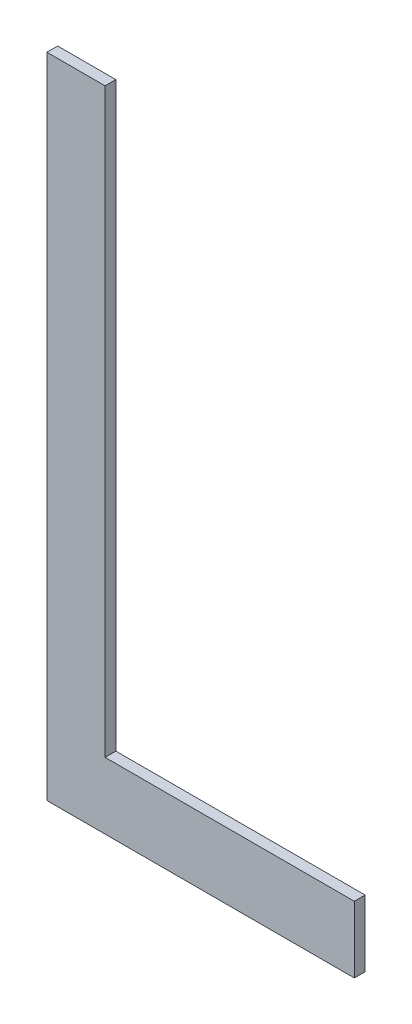
ISO-10303-21;
HEADER;
FILE_DESCRIPTION(('STEP AP214'),'2;1');
FILE_NAME('part.step','',(''),(''),'','','');
FILE_SCHEMA(('AUTOMOTIVE_DESIGN { 1 0 10303 214 1 1 1 1 }'));
ENDSEC;
DATA;
#1=APPLICATION_CONTEXT('core data for automotive mechanical design processes');
#2=APPLICATION_PROTOCOL_DEFINITION('international standard','automotive_design',2000,#1);
#3=PRODUCT_CONTEXT('',#1,'mechanical');
#4=PRODUCT('Part','Part','',(#3));
#5=PRODUCT_RELATED_PRODUCT_CATEGORY('part','',(#4));
#6=PRODUCT_DEFINITION_FORMATION('','',#4);
#7=PRODUCT_DEFINITION_CONTEXT('part definition',#1,'design');
#8=PRODUCT_DEFINITION('design','',#6,#7);
#9=PRODUCT_DEFINITION_SHAPE('','',#8);
#10=(LENGTH_UNIT() NAMED_UNIT(*) SI_UNIT(.MILLI.,.METRE.));
#11=(NAMED_UNIT(*) PLANE_ANGLE_UNIT() SI_UNIT($,.RADIAN.));
#12=(NAMED_UNIT(*) SI_UNIT($,.STERADIAN.) SOLID_ANGLE_UNIT());
#13=UNCERTAINTY_MEASURE_WITH_UNIT(LENGTH_MEASURE(1.E-05),#10,'distance_accuracy_value','');
#14=(GEOMETRIC_REPRESENTATION_CONTEXT(3) GLOBAL_UNCERTAINTY_ASSIGNED_CONTEXT((#13)) GLOBAL_UNIT_ASSIGNED_CONTEXT((#10,
#11,#12)) REPRESENTATION_CONTEXT('',''));
#15=CARTESIAN_POINT('',(0.,0.,0.));
#16=DIRECTION('',(0.,0.,1.));
#17=DIRECTION('',(1.,0.,0.));
#18=AXIS2_PLACEMENT_3D('',#15,#16,#17);
#19=CARTESIAN_POINT('',(1.42,0.190058603834586,0.551));
#20=DIRECTION('',(-1.,0.,0.));
#21=DIRECTION('',(0.,0.,1.));
#22=AXIS2_PLACEMENT_3D('',#19,#20,#21);
#23=PLANE('',#22);
#24=DIRECTION('',(0.,1.,0.));
#25=VECTOR('',#24,1.);
#26=CARTESIAN_POINT('',(1.42,0.190058603834586,0.55));
#27=LINE('',#26,#25);
#28=CARTESIAN_POINT('',(1.42,0.190058603834586,0.55));
#29=VERTEX_POINT('',#28);
#30=CARTESIAN_POINT('',(1.42,0.250058603834586,0.55));
#31=VERTEX_POINT('',#30);
#32=EDGE_CURVE('E11',#29,#31,#27,.T.);
#33=ORIENTED_EDGE('',*,*,#32,.F.);
#34=DIRECTION('',(0.,0.,-1.));
#35=VECTOR('',#34,1.);
#36=CARTESIAN_POINT('',(1.42,0.190058603834586,0.551));
#37=LINE('',#36,#35);
#38=CARTESIAN_POINT('',(1.42,0.190058603834586,0.551));
#39=VERTEX_POINT('',#38);
#40=EDGE_CURVE('E119',#39,#29,#37,.T.);
#41=ORIENTED_EDGE('',*,*,#40,.F.);
#42=DIRECTION('',(0.,1.,0.));
#43=VECTOR('',#42,1.);
#44=CARTESIAN_POINT('',(1.42,0.190058603834586,0.551));
#45=LINE('',#44,#43);
#46=CARTESIAN_POINT('',(1.42,0.250058603834586,0.551));
#47=VERTEX_POINT('',#46);
#48=EDGE_CURVE('E112',#39,#47,#45,.T.);
#49=ORIENTED_EDGE('',*,*,#48,.T.);
#50=DIRECTION('',(0.,0.,-1.));
#51=VECTOR('',#50,1.);
#52=CARTESIAN_POINT('',(1.42,0.250058603834586,0.551));
#53=LINE('',#52,#51);
#54=EDGE_CURVE('E85',#47,#31,#53,.T.);
#55=ORIENTED_EDGE('',*,*,#54,.T.);
#56=EDGE_LOOP('',(#33,#41,#49,#55));
#57=FACE_BOUND('',#56,.T.);
#58=ADVANCED_FACE('F17',(#57),#23,.T.);
#59=CARTESIAN_POINT('',(1.44846153846154,0.190058603834586,0.551));
#60=DIRECTION('',(0.,-1.,0.));
#61=DIRECTION('',(0.,0.,-1.));
#62=AXIS2_PLACEMENT_3D('',#59,#60,#61);
#63=PLANE('',#62);
#64=DIRECTION('',(-1.,0.,0.));
#65=VECTOR('',#64,1.);
#66=CARTESIAN_POINT('',(1.44846153846154,0.190058603834586,0.55));
#67=LINE('',#66,#65);
#68=CARTESIAN_POINT('',(1.44846153846154,0.190058603834586,0.55));
#69=VERTEX_POINT('',#68);
#70=EDGE_CURVE('E24',#69,#29,#67,.T.);
#71=ORIENTED_EDGE('',*,*,#70,.F.);
#72=DIRECTION('',(0.,0.,-1.));
#73=VECTOR('',#72,1.);
#74=CARTESIAN_POINT('',(1.44846153846154,0.190058603834586,0.551));
#75=LINE('',#74,#73);
#76=CARTESIAN_POINT('',(1.44846153846154,0.190058603834586,0.551));
#77=VERTEX_POINT('',#76);
#78=EDGE_CURVE('E114',#77,#69,#75,.T.);
#79=ORIENTED_EDGE('',*,*,#78,.F.);
#80=DIRECTION('',(-1.,0.,0.));
#81=VECTOR('',#80,1.);
#82=CARTESIAN_POINT('',(1.44846153846154,0.190058603834586,0.551));
#83=LINE('',#82,#81);
#84=EDGE_CURVE('E103',#77,#39,#83,.T.);
#85=ORIENTED_EDGE('',*,*,#84,.T.);
#86=ORIENTED_EDGE('',*,*,#40,.T.);
#87=EDGE_LOOP('',(#71,#79,#85,#86));
#88=FACE_BOUND('',#87,.T.);
#89=ADVANCED_FACE('F127',(#88),#63,.T.);
#90=CARTESIAN_POINT('',(1.44846153846154,0.196212449988433,0.551));
#91=DIRECTION('',(1.,0.,0.));
#92=DIRECTION('',(0.,0.,-1.));
#93=AXIS2_PLACEMENT_3D('',#90,#91,#92);
#94=PLANE('',#93);
#95=DIRECTION('',(0.,-1.,0.));
#96=VECTOR('',#95,1.);
#97=CARTESIAN_POINT('',(1.44846153846154,0.196212449988433,0.55));
#98=LINE('',#97,#96);
#99=CARTESIAN_POINT('',(1.44846153846154,0.196212449988433,0.55));
#100=VERTEX_POINT('',#99);
#101=EDGE_CURVE('E116',#100,#69,#98,.T.);
#102=ORIENTED_EDGE('',*,*,#101,.F.);
#103=DIRECTION('',(0.,0.,-1.));
#104=VECTOR('',#103,1.);
#105=CARTESIAN_POINT('',(1.44846153846154,0.196212449988433,0.551));
#106=LINE('',#105,#104);
#107=CARTESIAN_POINT('',(1.44846153846154,0.196212449988433,0.551));
#108=VERTEX_POINT('',#107);
#109=EDGE_CURVE('E106',#108,#100,#106,.T.);
#110=ORIENTED_EDGE('',*,*,#109,.F.);
#111=DIRECTION('',(0.,-1.,0.));
#112=VECTOR('',#111,1.);
#113=CARTESIAN_POINT('',(1.44846153846154,0.196212449988433,0.551));
#114=LINE('',#113,#112);
#115=EDGE_CURVE('E96',#108,#77,#114,.T.);
#116=ORIENTED_EDGE('',*,*,#115,.T.);
#117=ORIENTED_EDGE('',*,*,#78,.T.);
#118=EDGE_LOOP('',(#102,#110,#116,#117));
#119=FACE_BOUND('',#118,.T.);
#120=ADVANCED_FACE('F123',(#119),#94,.T.);
#121=CARTESIAN_POINT('',(1.42538461538462,0.196212449988433,0.551));
#122=DIRECTION('',(0.,1.,0.));
#123=DIRECTION('',(0.,0.,1.));
#124=AXIS2_PLACEMENT_3D('',#121,#122,#123);
#125=PLANE('',#124);
#126=DIRECTION('',(1.,0.,0.));
#127=VECTOR('',#126,1.);
#128=CARTESIAN_POINT('',(1.42538461538462,0.196212449988433,0.55));
#129=LINE('',#128,#127);
#130=CARTESIAN_POINT('',(1.42538461538462,0.196212449988433,0.55));
#131=VERTEX_POINT('',#130);
#132=EDGE_CURVE('E109',#131,#100,#129,.T.);
#133=ORIENTED_EDGE('',*,*,#132,.F.);
#134=DIRECTION('',(0.,0.,-1.));
#135=VECTOR('',#134,1.);
#136=CARTESIAN_POINT('',(1.42538461538462,0.196212449988433,0.551));
#137=LINE('',#136,#135);
#138=CARTESIAN_POINT('',(1.42538461538462,0.196212449988433,0.551));
#139=VERTEX_POINT('',#138);
#140=EDGE_CURVE('E99',#139,#131,#137,.T.);
#141=ORIENTED_EDGE('',*,*,#140,.F.);
#142=DIRECTION('',(1.,0.,0.));
#143=VECTOR('',#142,1.);
#144=CARTESIAN_POINT('',(1.42538461538462,0.196212449988433,0.551));
#145=LINE('',#144,#143);
#146=EDGE_CURVE('E79',#139,#108,#145,.T.);
#147=ORIENTED_EDGE('',*,*,#146,.T.);
#148=ORIENTED_EDGE('',*,*,#109,.T.);
#149=EDGE_LOOP('',(#133,#141,#147,#148));
#150=FACE_BOUND('',#149,.T.);
#151=ADVANCED_FACE('F125',(#150),#125,.T.);
#152=CARTESIAN_POINT('',(1.42538461538462,0.250058603834586,0.551));
#153=DIRECTION('',(1.,0.,0.));
#154=DIRECTION('',(0.,0.,-1.));
#155=AXIS2_PLACEMENT_3D('',#152,#153,#154);
#156=PLANE('',#155);
#157=DIRECTION('',(0.,-1.,0.));
#158=VECTOR('',#157,1.);
#159=CARTESIAN_POINT('',(1.42538461538462,0.250058603834586,0.55));
#160=LINE('',#159,#158);
#161=CARTESIAN_POINT('',(1.42538461538462,0.250058603834586,0.55));
#162=VERTEX_POINT('',#161);
#163=EDGE_CURVE('E74',#162,#131,#160,.T.);
#164=ORIENTED_EDGE('',*,*,#163,.F.);
#165=DIRECTION('',(0.,0.,-1.));
#166=VECTOR('',#165,1.);
#167=CARTESIAN_POINT('',(1.42538461538462,0.250058603834586,0.551));
#168=LINE('',#167,#166);
#169=CARTESIAN_POINT('',(1.42538461538462,0.250058603834586,0.551));
#170=VERTEX_POINT('',#169);
#171=EDGE_CURVE('E66',#170,#162,#168,.T.);
#172=ORIENTED_EDGE('',*,*,#171,.F.);
#173=DIRECTION('',(0.,-1.,0.));
#174=VECTOR('',#173,1.);
#175=CARTESIAN_POINT('',(1.42538461538462,0.250058603834586,0.551));
#176=LINE('',#175,#174);
#177=EDGE_CURVE('E71',#170,#139,#176,.T.);
#178=ORIENTED_EDGE('',*,*,#177,.T.);
#179=ORIENTED_EDGE('',*,*,#140,.T.);
#180=EDGE_LOOP('',(#164,#172,#178,#179));
#181=FACE_BOUND('',#180,.T.);
#182=ADVANCED_FACE('F68',(#181),#156,.T.);
#183=CARTESIAN_POINT('',(1.42,0.250058603834586,0.551));
#184=DIRECTION('',(0.,1.,0.));
#185=DIRECTION('',(0.,0.,1.));
#186=AXIS2_PLACEMENT_3D('',#183,#184,#185);
#187=PLANE('',#186);
#188=DIRECTION('',(1.,0.,0.));
#189=VECTOR('',#188,1.);
#190=CARTESIAN_POINT('',(1.42,0.250058603834586,0.55));
#191=LINE('',#190,#189);
#192=EDGE_CURVE('E78',#31,#162,#191,.T.);
#193=ORIENTED_EDGE('',*,*,#192,.F.);
#194=ORIENTED_EDGE('',*,*,#54,.F.);
#195=DIRECTION('',(1.,0.,0.));
#196=VECTOR('',#195,1.);
#197=CARTESIAN_POINT('',(1.42,0.250058603834586,0.551));
#198=LINE('',#197,#196);
#199=EDGE_CURVE('E83',#47,#170,#198,.T.);
#200=ORIENTED_EDGE('',*,*,#199,.T.);
#201=ORIENTED_EDGE('',*,*,#171,.T.);
#202=EDGE_LOOP('',(#193,#194,#200,#201));
#203=FACE_BOUND('',#202,.T.);
#204=ADVANCED_FACE('F84',(#203),#187,.T.);
#205=CARTESIAN_POINT('',(0.,0.,0.551));
#206=DIRECTION('',(0.,0.,-1.));
#207=DIRECTION('',(-1.,0.,0.));
#208=AXIS2_PLACEMENT_3D('',#205,#206,#207);
#209=PLANE('',#208);
#210=ORIENTED_EDGE('',*,*,#48,.F.);
#211=ORIENTED_EDGE('',*,*,#84,.F.);
#212=ORIENTED_EDGE('',*,*,#115,.F.);
#213=ORIENTED_EDGE('',*,*,#146,.F.);
#214=ORIENTED_EDGE('',*,*,#177,.F.);
#215=ORIENTED_EDGE('',*,*,#199,.F.);
#216=EDGE_LOOP('',(#210,#211,#212,#213,#214,#215));
#217=FACE_BOUND('',#216,.T.);
#218=ADVANCED_FACE('F89',(#217),#209,.F.);
#219=CARTESIAN_POINT('',(0.,0.,0.55));
#220=DIRECTION('',(0.,0.,-1.));
#221=DIRECTION('',(-1.,0.,0.));
#222=AXIS2_PLACEMENT_3D('',#219,#220,#221);
#223=PLANE('',#222);
#224=ORIENTED_EDGE('',*,*,#32,.T.);
#225=ORIENTED_EDGE('',*,*,#192,.T.);
#226=ORIENTED_EDGE('',*,*,#163,.T.);
#227=ORIENTED_EDGE('',*,*,#132,.T.);
#228=ORIENTED_EDGE('',*,*,#101,.T.);
#229=ORIENTED_EDGE('',*,*,#70,.T.);
#230=EDGE_LOOP('',(#224,#225,#226,#227,#228,#229));
#231=FACE_BOUND('',#230,.T.);
#232=ADVANCED_FACE('F121',(#231),#223,.T.);
#233=CLOSED_SHELL('',(#58,#89,#120,#151,#182,#204,#218,#232));
#234=MANIFOLD_SOLID_BREP('B1',#233);
#235=ADVANCED_BREP_SHAPE_REPRESENTATION('',(#18,#234),#14);
#236=SHAPE_DEFINITION_REPRESENTATION(#9,#235);
ENDSEC;
END-ISO-10303-21;
